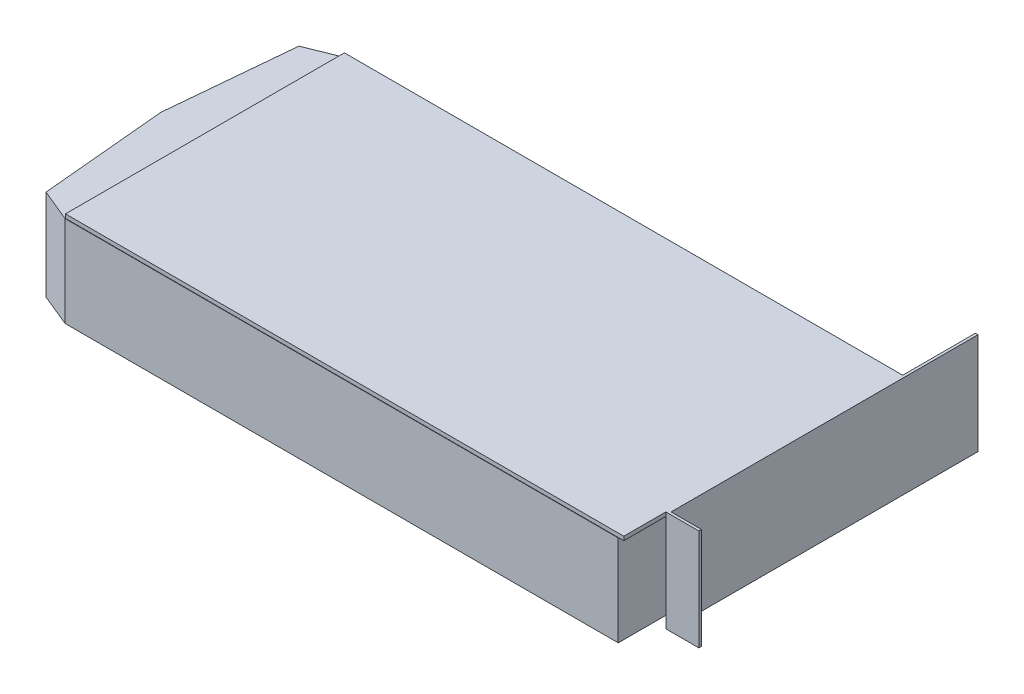
ISO-10303-21;
HEADER;
FILE_DESCRIPTION(('STEP AP214'),'2;1');
FILE_NAME('part.step','',(''),(''),'','','');
FILE_SCHEMA(('AUTOMOTIVE_DESIGN { 1 0 10303 214 1 1 1 1 }'));
ENDSEC;
DATA;
#1=APPLICATION_CONTEXT('core data for automotive mechanical design processes');
#2=APPLICATION_PROTOCOL_DEFINITION('international standard','automotive_design',2000,#1);
#3=PRODUCT_CONTEXT('',#1,'mechanical');
#4=PRODUCT('Part','Part','',(#3));
#5=PRODUCT_RELATED_PRODUCT_CATEGORY('part','',(#4));
#6=PRODUCT_DEFINITION_FORMATION('','',#4);
#7=PRODUCT_DEFINITION_CONTEXT('part definition',#1,'design');
#8=PRODUCT_DEFINITION('design','',#6,#7);
#9=PRODUCT_DEFINITION_SHAPE('','',#8);
#10=(LENGTH_UNIT() NAMED_UNIT(*) SI_UNIT(.MILLI.,.METRE.));
#11=(NAMED_UNIT(*) PLANE_ANGLE_UNIT() SI_UNIT($,.RADIAN.));
#12=(NAMED_UNIT(*) SI_UNIT($,.STERADIAN.) SOLID_ANGLE_UNIT());
#13=UNCERTAINTY_MEASURE_WITH_UNIT(LENGTH_MEASURE(1.E-05),#10,'distance_accuracy_value','');
#14=(GEOMETRIC_REPRESENTATION_CONTEXT(3) GLOBAL_UNCERTAINTY_ASSIGNED_CONTEXT((#13)) GLOBAL_UNIT_ASSIGNED_CONTEXT((#10,
#11,#12)) REPRESENTATION_CONTEXT('',''));
#15=CARTESIAN_POINT('',(0.,0.,0.));
#16=DIRECTION('',(0.,0.,1.));
#17=DIRECTION('',(1.,0.,0.));
#18=AXIS2_PLACEMENT_3D('',#15,#16,#17);
#19=CARTESIAN_POINT('',(0.,0.,0.));
#20=DIRECTION('',(0.,1.,0.));
#21=DIRECTION('',(0.,0.,1.));
#22=AXIS2_PLACEMENT_3D('',#19,#20,#21);
#23=PLANE('',#22);
#24=DIRECTION('',(0.,0.,1.));
#25=VECTOR('',#24,1.);
#26=CARTESIAN_POINT('',(213.,0.,0.));
#27=LINE('',#26,#25);
#28=CARTESIAN_POINT('',(213.,0.,-107.4));
#29=VERTEX_POINT('',#28);
#30=CARTESIAN_POINT('',(213.,0.,0.));
#31=VERTEX_POINT('',#30);
#32=EDGE_CURVE('E55',#29,#31,#27,.T.);
#33=ORIENTED_EDGE('',*,*,#32,.F.);
#34=DIRECTION('',(-1.,0.,0.));
#35=VECTOR('',#34,1.);
#36=CARTESIAN_POINT('',(0.,0.,-107.4));
#37=LINE('',#36,#35);
#38=CARTESIAN_POINT('',(215.,0.,-107.4));
#39=VERTEX_POINT('',#38);
#40=EDGE_CURVE('E285',#39,#29,#37,.T.);
#41=ORIENTED_EDGE('',*,*,#40,.F.);
#42=DIRECTION('',(0.,0.,-1.));
#43=VECTOR('',#42,1.);
#44=CARTESIAN_POINT('',(215.,0.,0.));
#45=LINE('',#44,#43);
#46=CARTESIAN_POINT('',(215.,0.,-16.2));
#47=VERTEX_POINT('',#46);
#48=EDGE_CURVE('E281',#47,#39,#45,.T.);
#49=ORIENTED_EDGE('',*,*,#48,.F.);
#50=CARTESIAN_POINT('',(215.,0.,0.));
#51=VERTEX_POINT('',#50);
#52=EDGE_CURVE('E282',#51,#47,#45,.T.);
#53=ORIENTED_EDGE('',*,*,#52,.F.);
#54=DIRECTION('',(1.,0.,0.));
#55=VECTOR('',#54,1.);
#56=CARTESIAN_POINT('',(0.,0.,0.));
#57=LINE('',#56,#55);
#58=EDGE_CURVE('E261',#31,#51,#57,.T.);
#59=ORIENTED_EDGE('',*,*,#58,.F.);
#60=EDGE_LOOP('',(#33,#41,#49,#53,#59));
#61=FACE_BOUND('',#60,.T.);
#62=ADVANCED_FACE('F39',(#61),#23,.F.);
#63=CARTESIAN_POINT('',(215.,1.5,0.));
#64=DIRECTION('',(-1.,0.,0.));
#65=DIRECTION('',(0.,0.,1.));
#66=AXIS2_PLACEMENT_3D('',#63,#64,#65);
#67=PLANE('',#66);
#68=DIRECTION('',(0.,-1.,0.));
#69=VECTOR('',#68,1.);
#70=CARTESIAN_POINT('',(215.,1.5,-16.2));
#71=LINE('',#70,#69);
#72=CARTESIAN_POINT('',(215.,1.5,-16.2));
#73=VERTEX_POINT('',#72);
#74=EDGE_CURVE('E237',#73,#47,#71,.T.);
#75=ORIENTED_EDGE('',*,*,#74,.F.);
#76=DIRECTION('',(0.,0.,-1.));
#77=VECTOR('',#76,1.);
#78=CARTESIAN_POINT('',(215.,1.5,0.));
#79=LINE('',#78,#77);
#80=CARTESIAN_POINT('',(215.,1.5,0.));
#81=VERTEX_POINT('',#80);
#82=EDGE_CURVE('E266',#81,#73,#79,.T.);
#83=ORIENTED_EDGE('',*,*,#82,.F.);
#84=DIRECTION('',(0.,-1.,0.));
#85=VECTOR('',#84,1.);
#86=CARTESIAN_POINT('',(215.,1.5,0.));
#87=LINE('',#86,#85);
#88=EDGE_CURVE('E11',#81,#51,#87,.T.);
#89=ORIENTED_EDGE('',*,*,#88,.T.);
#90=ORIENTED_EDGE('',*,*,#52,.T.);
#91=EDGE_LOOP('',(#75,#83,#89,#90));
#92=FACE_BOUND('',#91,.T.);
#93=ADVANCED_FACE('F338',(#92),#67,.F.);
#94=CARTESIAN_POINT('',(0.,1.5,0.));
#95=DIRECTION('',(0.,0.,-1.));
#96=DIRECTION('',(-1.,0.,0.));
#97=AXIS2_PLACEMENT_3D('',#94,#95,#96);
#98=PLANE('',#97);
#99=CARTESIAN_POINT('',(0.,0.,0.));
#100=VERTEX_POINT('',#99);
#101=EDGE_CURVE('E278',#100,#31,#57,.T.);
#102=ORIENTED_EDGE('',*,*,#101,.T.);
#103=ORIENTED_EDGE('',*,*,#58,.T.);
#104=ORIENTED_EDGE('',*,*,#88,.F.);
#105=DIRECTION('',(1.,0.,0.));
#106=VECTOR('',#105,1.);
#107=CARTESIAN_POINT('',(0.,1.5,0.));
#108=LINE('',#107,#106);
#109=CARTESIAN_POINT('',(0.,1.5,0.));
#110=VERTEX_POINT('',#109);
#111=EDGE_CURVE('E262',#110,#81,#108,.T.);
#112=ORIENTED_EDGE('',*,*,#111,.F.);
#113=DIRECTION('',(0.,-1.,0.));
#114=VECTOR('',#113,1.);
#115=CARTESIAN_POINT('',(0.,1.5,0.));
#116=LINE('',#115,#114);
#117=EDGE_CURVE('E277',#110,#100,#116,.T.);
#118=ORIENTED_EDGE('',*,*,#117,.T.);
#119=EDGE_LOOP('',(#102,#103,#104,#112,#118));
#120=FACE_BOUND('',#119,.T.);
#121=ADVANCED_FACE('F41',(#120),#98,.F.);
#122=CARTESIAN_POINT('',(0.,1.5,-107.4));
#123=DIRECTION('',(0.,0.,1.));
#124=DIRECTION('',(1.,0.,0.));
#125=AXIS2_PLACEMENT_3D('',#122,#123,#124);
#126=PLANE('',#125);
#127=ORIENTED_EDGE('',*,*,#40,.T.);
#128=DIRECTION('',(0.,1.,0.));
#129=VECTOR('',#128,1.);
#130=CARTESIAN_POINT('',(213.,-35.,-107.4));
#131=LINE('',#130,#129);
#132=CARTESIAN_POINT('',(213.,-35.,-107.4));
#133=VERTEX_POINT('',#132);
#134=EDGE_CURVE('E349',#133,#29,#131,.T.);
#135=ORIENTED_EDGE('',*,*,#134,.F.);
#136=DIRECTION('',(1.,0.,0.));
#137=VECTOR('',#136,1.);
#138=CARTESIAN_POINT('',(213.,-35.,-107.4));
#139=LINE('',#138,#137);
#140=CARTESIAN_POINT('',(0.,-35.,-107.4));
#141=VERTEX_POINT('',#140);
#142=EDGE_CURVE('E180',#141,#133,#139,.T.);
#143=ORIENTED_EDGE('',*,*,#142,.F.);
#144=DIRECTION('',(0.,1.,0.));
#145=VECTOR('',#144,1.);
#146=CARTESIAN_POINT('',(0.,-35.,-107.4));
#147=LINE('',#146,#145);
#148=CARTESIAN_POINT('',(0.,0.,-107.4));
#149=VERTEX_POINT('',#148);
#150=EDGE_CURVE('E356',#141,#149,#147,.T.);
#151=ORIENTED_EDGE('',*,*,#150,.T.);
#152=DIRECTION('',(0.,-1.,0.));
#153=VECTOR('',#152,1.);
#154=CARTESIAN_POINT('',(0.,1.5,-107.4));
#155=LINE('',#154,#153);
#156=CARTESIAN_POINT('',(0.,1.5,-107.4));
#157=VERTEX_POINT('',#156);
#158=EDGE_CURVE('E293',#157,#149,#155,.T.);
#159=ORIENTED_EDGE('',*,*,#158,.F.);
#160=DIRECTION('',(-1.,0.,0.));
#161=VECTOR('',#160,1.);
#162=CARTESIAN_POINT('',(0.,1.5,-107.4));
#163=LINE('',#162,#161);
#164=CARTESIAN_POINT('',(215.,1.5,-107.4));
#165=VERTEX_POINT('',#164);
#166=EDGE_CURVE('E271',#165,#157,#163,.T.);
#167=ORIENTED_EDGE('',*,*,#166,.F.);
#168=DIRECTION('',(0.,-1.,0.));
#169=VECTOR('',#168,1.);
#170=CARTESIAN_POINT('',(215.,1.5,-107.4));
#171=LINE('',#170,#169);
#172=EDGE_CURVE('E48',#165,#39,#171,.T.);
#173=ORIENTED_EDGE('',*,*,#172,.T.);
#174=EDGE_LOOP('',(#127,#135,#143,#151,#159,#167,#173));
#175=FACE_BOUND('',#174,.T.);
#176=ADVANCED_FACE('F298',(#175),#126,.F.);
#177=CARTESIAN_POINT('',(0.,1.5,0.));
#178=DIRECTION('',(1.,0.,0.));
#179=DIRECTION('',(0.,0.,-1.));
#180=AXIS2_PLACEMENT_3D('',#177,#178,#179);
#181=PLANE('',#180);
#182=DIRECTION('',(0.,0.,1.));
#183=VECTOR('',#182,1.);
#184=CARTESIAN_POINT('',(0.,0.,0.));
#185=LINE('',#184,#183);
#186=EDGE_CURVE('E267',#149,#100,#185,.T.);
#187=ORIENTED_EDGE('',*,*,#186,.T.);
#188=ORIENTED_EDGE('',*,*,#117,.F.);
#189=DIRECTION('',(0.,0.,1.));
#190=VECTOR('',#189,1.);
#191=CARTESIAN_POINT('',(0.,1.5,0.));
#192=LINE('',#191,#190);
#193=EDGE_CURVE('E274',#157,#110,#192,.T.);
#194=ORIENTED_EDGE('',*,*,#193,.F.);
#195=ORIENTED_EDGE('',*,*,#158,.T.);
#196=EDGE_LOOP('',(#187,#188,#194,#195));
#197=FACE_BOUND('',#196,.T.);
#198=ADVANCED_FACE('F421',(#197),#181,.F.);
#199=CARTESIAN_POINT('',(0.,1.5,0.));
#200=DIRECTION('',(0.,1.,0.));
#201=DIRECTION('',(0.,0.,1.));
#202=AXIS2_PLACEMENT_3D('',#199,#200,#201);
#203=PLANE('',#202);
#204=ORIENTED_EDGE('',*,*,#111,.T.);
#205=ORIENTED_EDGE('',*,*,#82,.T.);
#206=DIRECTION('',(-1.,0.,0.));
#207=VECTOR('',#206,1.);
#208=CARTESIAN_POINT('',(216.,1.5,-16.2));
#209=LINE('',#208,#207);
#210=CARTESIAN_POINT('',(227.7,1.5,-16.2));
#211=VERTEX_POINT('',#210);
#212=EDGE_CURVE('E257',#211,#73,#209,.T.);
#213=ORIENTED_EDGE('',*,*,#212,.F.);
#214=DIRECTION('',(0.,0.,1.));
#215=VECTOR('',#214,1.);
#216=CARTESIAN_POINT('',(227.7,1.5,-16.2));
#217=LINE('',#216,#215);
#218=CARTESIAN_POINT('',(227.7,1.5,-17.2));
#219=VERTEX_POINT('',#218);
#220=EDGE_CURVE('E209',#219,#211,#217,.T.);
#221=ORIENTED_EDGE('',*,*,#220,.F.);
#222=DIRECTION('',(-1.,0.,0.));
#223=VECTOR('',#222,1.);
#224=CARTESIAN_POINT('',(227.7,1.5,-17.2));
#225=LINE('',#224,#223);
#226=CARTESIAN_POINT('',(216.,1.5,-17.2));
#227=VERTEX_POINT('',#226);
#228=EDGE_CURVE('E212',#219,#227,#225,.T.);
#229=ORIENTED_EDGE('',*,*,#228,.T.);
#230=DIRECTION('',(0.,0.,1.));
#231=VECTOR('',#230,1.);
#232=CARTESIAN_POINT('',(216.,1.5,-16.2));
#233=LINE('',#232,#231);
#234=CARTESIAN_POINT('',(216.,1.5,-135.4));
#235=VERTEX_POINT('',#234);
#236=EDGE_CURVE('E222',#235,#227,#233,.T.);
#237=ORIENTED_EDGE('',*,*,#236,.F.);
#238=DIRECTION('',(-1.,0.,0.));
#239=VECTOR('',#238,1.);
#240=CARTESIAN_POINT('',(216.,1.5,-135.4));
#241=LINE('',#240,#239);
#242=CARTESIAN_POINT('',(215.,1.5,-135.4));
#243=VERTEX_POINT('',#242);
#244=EDGE_CURVE('E232',#235,#243,#241,.T.);
#245=ORIENTED_EDGE('',*,*,#244,.T.);
#246=DIRECTION('',(0.,0.,1.));
#247=VECTOR('',#246,1.);
#248=CARTESIAN_POINT('',(215.,1.5,-16.2));
#249=LINE('',#248,#247);
#250=EDGE_CURVE('E221',#243,#165,#249,.T.);
#251=ORIENTED_EDGE('',*,*,#250,.T.);
#252=ORIENTED_EDGE('',*,*,#166,.T.);
#253=ORIENTED_EDGE('',*,*,#193,.T.);
#254=EDGE_LOOP('',(#204,#205,#213,#221,#229,#237,#245,#251,#252,#253));
#255=FACE_BOUND('',#254,.T.);
#256=ADVANCED_FACE('F326',(#255),#203,.T.);
#257=CARTESIAN_POINT('',(215.,0.,0.));
#258=DIRECTION('',(1.,0.,0.));
#259=DIRECTION('',(0.,0.,-1.));
#260=AXIS2_PLACEMENT_3D('',#257,#258,#259);
#261=PLANE('',#260);
#262=CARTESIAN_POINT('',(215.,-37.5,-16.2));
#263=VERTEX_POINT('',#262);
#264=EDGE_CURVE('E236',#47,#263,#71,.T.);
#265=ORIENTED_EDGE('',*,*,#264,.F.);
#266=ORIENTED_EDGE('',*,*,#48,.T.);
#267=ORIENTED_EDGE('',*,*,#172,.F.);
#268=ORIENTED_EDGE('',*,*,#250,.F.);
#269=DIRECTION('',(0.,1.,0.));
#270=VECTOR('',#269,1.);
#271=CARTESIAN_POINT('',(215.,-37.5,-135.4));
#272=LINE('',#271,#270);
#273=CARTESIAN_POINT('',(215.,-37.5,-135.4));
#274=VERTEX_POINT('',#273);
#275=EDGE_CURVE('E226',#274,#243,#272,.T.);
#276=ORIENTED_EDGE('',*,*,#275,.F.);
#277=DIRECTION('',(0.,0.,-1.));
#278=VECTOR('',#277,1.);
#279=CARTESIAN_POINT('',(215.,-37.5,-16.2));
#280=LINE('',#279,#278);
#281=EDGE_CURVE('E241',#263,#274,#280,.T.);
#282=ORIENTED_EDGE('',*,*,#281,.F.);
#283=EDGE_LOOP('',(#265,#266,#267,#268,#276,#282));
#284=FACE_BOUND('',#283,.T.);
#285=ADVANCED_FACE('F306',(#284),#261,.F.);
#286=CARTESIAN_POINT('',(216.,1.5,-16.2));
#287=DIRECTION('',(0.,0.,-1.));
#288=DIRECTION('',(0.,1.,0.));
#289=AXIS2_PLACEMENT_3D('',#286,#287,#288);
#290=PLANE('',#289);
#291=ORIENTED_EDGE('',*,*,#74,.T.);
#292=ORIENTED_EDGE('',*,*,#264,.T.);
#293=DIRECTION('',(-1.,0.,0.));
#294=VECTOR('',#293,1.);
#295=CARTESIAN_POINT('',(216.,-37.5,-16.2));
#296=LINE('',#295,#294);
#297=CARTESIAN_POINT('',(227.7,-37.5,-16.2));
#298=VERTEX_POINT('',#297);
#299=EDGE_CURVE('E253',#298,#263,#296,.T.);
#300=ORIENTED_EDGE('',*,*,#299,.F.);
#301=DIRECTION('',(0.,-1.,0.));
#302=VECTOR('',#301,1.);
#303=CARTESIAN_POINT('',(227.7,-37.5,-16.2));
#304=LINE('',#303,#302);
#305=EDGE_CURVE('E194',#211,#298,#304,.T.);
#306=ORIENTED_EDGE('',*,*,#305,.F.);
#307=ORIENTED_EDGE('',*,*,#212,.T.);
#308=EDGE_LOOP('',(#291,#292,#300,#306,#307));
#309=FACE_BOUND('',#308,.T.);
#310=ADVANCED_FACE('F312',(#309),#290,.F.);
#311=CARTESIAN_POINT('',(216.,-37.5,-16.2));
#312=DIRECTION('',(0.,1.,0.));
#313=DIRECTION('',(0.,0.,1.));
#314=AXIS2_PLACEMENT_3D('',#311,#312,#313);
#315=PLANE('',#314);
#316=ORIENTED_EDGE('',*,*,#281,.T.);
#317=DIRECTION('',(-1.,0.,0.));
#318=VECTOR('',#317,1.);
#319=CARTESIAN_POINT('',(216.,-37.5,-135.4));
#320=LINE('',#319,#318);
#321=CARTESIAN_POINT('',(216.,-37.5,-135.4));
#322=VERTEX_POINT('',#321);
#323=EDGE_CURVE('E249',#322,#274,#320,.T.);
#324=ORIENTED_EDGE('',*,*,#323,.F.);
#325=DIRECTION('',(0.,0.,-1.));
#326=VECTOR('',#325,1.);
#327=CARTESIAN_POINT('',(216.,-37.5,-16.2));
#328=LINE('',#327,#326);
#329=CARTESIAN_POINT('',(216.,-37.5,-17.2));
#330=VERTEX_POINT('',#329);
#331=EDGE_CURVE('E225',#330,#322,#328,.T.);
#332=ORIENTED_EDGE('',*,*,#331,.F.);
#333=DIRECTION('',(-1.,0.,0.));
#334=VECTOR('',#333,1.);
#335=CARTESIAN_POINT('',(227.7,-37.5,-17.2));
#336=LINE('',#335,#334);
#337=CARTESIAN_POINT('',(227.7,-37.5,-17.2));
#338=VERTEX_POINT('',#337);
#339=EDGE_CURVE('E217',#338,#330,#336,.T.);
#340=ORIENTED_EDGE('',*,*,#339,.F.);
#341=DIRECTION('',(0.,0.,-1.));
#342=VECTOR('',#341,1.);
#343=CARTESIAN_POINT('',(227.7,-37.5,-17.2));
#344=LINE('',#343,#342);
#345=EDGE_CURVE('E203',#298,#338,#344,.T.);
#346=ORIENTED_EDGE('',*,*,#345,.F.);
#347=ORIENTED_EDGE('',*,*,#299,.T.);
#348=EDGE_LOOP('',(#316,#324,#332,#340,#346,#347));
#349=FACE_BOUND('',#348,.T.);
#350=ADVANCED_FACE('F316',(#349),#315,.F.);
#351=CARTESIAN_POINT('',(216.,-37.5,-135.4));
#352=DIRECTION('',(0.,0.,1.));
#353=DIRECTION('',(1.,0.,0.));
#354=AXIS2_PLACEMENT_3D('',#351,#352,#353);
#355=PLANE('',#354);
#356=ORIENTED_EDGE('',*,*,#275,.T.);
#357=ORIENTED_EDGE('',*,*,#244,.F.);
#358=DIRECTION('',(0.,1.,0.));
#359=VECTOR('',#358,1.);
#360=CARTESIAN_POINT('',(216.,-37.5,-135.4));
#361=LINE('',#360,#359);
#362=EDGE_CURVE('E229',#322,#235,#361,.T.);
#363=ORIENTED_EDGE('',*,*,#362,.F.);
#364=ORIENTED_EDGE('',*,*,#323,.T.);
#365=EDGE_LOOP('',(#356,#357,#363,#364));
#366=FACE_BOUND('',#365,.T.);
#367=ADVANCED_FACE('F322',(#366),#355,.F.);
#368=CARTESIAN_POINT('',(216.,0.,0.));
#369=DIRECTION('',(1.,0.,0.));
#370=DIRECTION('',(0.,0.,-1.));
#371=AXIS2_PLACEMENT_3D('',#368,#369,#370);
#372=PLANE('',#371);
#373=DIRECTION('',(0.,1.,0.));
#374=VECTOR('',#373,1.);
#375=CARTESIAN_POINT('',(216.,1.5,-17.2));
#376=LINE('',#375,#374);
#377=EDGE_CURVE('E63',#330,#227,#376,.T.);
#378=ORIENTED_EDGE('',*,*,#377,.F.);
#379=ORIENTED_EDGE('',*,*,#331,.T.);
#380=ORIENTED_EDGE('',*,*,#362,.T.);
#381=ORIENTED_EDGE('',*,*,#236,.T.);
#382=EDGE_LOOP('',(#378,#379,#380,#381));
#383=FACE_BOUND('',#382,.T.);
#384=ADVANCED_FACE('F329',(#383),#372,.T.);
#385=CARTESIAN_POINT('',(227.7,1.5,-17.2));
#386=DIRECTION('',(0.,0.,1.));
#387=DIRECTION('',(1.,0.,0.));
#388=AXIS2_PLACEMENT_3D('',#385,#386,#387);
#389=PLANE('',#388);
#390=ORIENTED_EDGE('',*,*,#377,.T.);
#391=ORIENTED_EDGE('',*,*,#228,.F.);
#392=DIRECTION('',(0.,1.,0.));
#393=VECTOR('',#392,1.);
#394=CARTESIAN_POINT('',(227.7,1.5,-17.2));
#395=LINE('',#394,#393);
#396=EDGE_CURVE('E206',#338,#219,#395,.T.);
#397=ORIENTED_EDGE('',*,*,#396,.F.);
#398=ORIENTED_EDGE('',*,*,#339,.T.);
#399=EDGE_LOOP('',(#390,#391,#397,#398));
#400=FACE_BOUND('',#399,.T.);
#401=ADVANCED_FACE('F331',(#400),#389,.F.);
#402=CARTESIAN_POINT('',(227.7,0.,0.));
#403=DIRECTION('',(-1.,0.,0.));
#404=DIRECTION('',(0.,0.,1.));
#405=AXIS2_PLACEMENT_3D('',#402,#403,#404);
#406=PLANE('',#405);
#407=ORIENTED_EDGE('',*,*,#305,.T.);
#408=ORIENTED_EDGE('',*,*,#345,.T.);
#409=ORIENTED_EDGE('',*,*,#396,.T.);
#410=ORIENTED_EDGE('',*,*,#220,.T.);
#411=EDGE_LOOP('',(#407,#408,#409,#410));
#412=FACE_BOUND('',#411,.T.);
#413=ADVANCED_FACE('F334',(#412),#406,.F.);
#414=CARTESIAN_POINT('',(0.,0.,0.));
#415=DIRECTION('',(0.,1.,0.));
#416=DIRECTION('',(0.,0.,1.));
#417=AXIS2_PLACEMENT_3D('',#414,#415,#416);
#418=PLANE('',#417);
#419=ORIENTED_EDGE('',*,*,#101,.F.);
#420=ORIENTED_EDGE('',*,*,#186,.F.);
#421=DIRECTION('',(0.928476690885259,0.,-0.371390676354104));
#422=VECTOR('',#421,1.);
#423=CARTESIAN_POINT('',(0.,0.,-107.4));
#424=LINE('',#423,#422);
#425=CARTESIAN_POINT('',(-12.5,0.,-102.4));
#426=VERTEX_POINT('',#425);
#427=EDGE_CURVE('E347',#426,#149,#424,.T.);
#428=ORIENTED_EDGE('',*,*,#427,.F.);
#429=DIRECTION('',(0.092010496247355,0.,-0.995758037165814));
#430=VECTOR('',#429,1.);
#431=CARTESIAN_POINT('',(-17.,0.,-53.7));
#432=LINE('',#431,#430);
#433=CARTESIAN_POINT('',(-17.,0.,-53.7));
#434=VERTEX_POINT('',#433);
#435=EDGE_CURVE('E381',#434,#426,#432,.T.);
#436=ORIENTED_EDGE('',*,*,#435,.F.);
#437=DIRECTION('',(-0.0920104962473547,0.,-0.995758037165815));
#438=VECTOR('',#437,1.);
#439=CARTESIAN_POINT('',(-17.,0.,-53.7));
#440=LINE('',#439,#438);
#441=CARTESIAN_POINT('',(-12.5,0.,-5.));
#442=VERTEX_POINT('',#441);
#443=EDGE_CURVE('E375',#442,#434,#440,.T.);
#444=ORIENTED_EDGE('',*,*,#443,.F.);
#445=DIRECTION('',(-0.924833288805006,0.,-0.380372696073359));
#446=VECTOR('',#445,1.);
#447=CARTESIAN_POINT('',(-12.5,0.,-5.));
#448=LINE('',#447,#446);
#449=CARTESIAN_POINT('',(0.,0.,0.141098140034046));
#450=VERTEX_POINT('',#449);
#451=EDGE_CURVE('E379',#450,#442,#448,.T.);
#452=ORIENTED_EDGE('',*,*,#451,.F.);
#453=DIRECTION('',(-1.,0.,0.));
#454=VECTOR('',#453,1.);
#455=CARTESIAN_POINT('',(0.,0.,0.141098140034046));
#456=LINE('',#455,#454);
#457=CARTESIAN_POINT('',(213.,0.,0.141098140034046));
#458=VERTEX_POINT('',#457);
#459=EDGE_CURVE('E345',#458,#450,#456,.T.);
#460=ORIENTED_EDGE('',*,*,#459,.F.);
#461=EDGE_CURVE('E188',#31,#458,#27,.T.);
#462=ORIENTED_EDGE('',*,*,#461,.F.);
#463=EDGE_LOOP('',(#419,#420,#428,#436,#444,#452,#460,#462));
#464=FACE_BOUND('',#463,.T.);
#465=ADVANCED_FACE('F342',(#464),#418,.T.);
#466=CARTESIAN_POINT('',(0.,-35.,0.141098140034046));
#467=DIRECTION('',(0.,0.,-1.));
#468=DIRECTION('',(-1.,0.,0.));
#469=AXIS2_PLACEMENT_3D('',#466,#467,#468);
#470=PLANE('',#469);
#471=ORIENTED_EDGE('',*,*,#459,.T.);
#472=DIRECTION('',(0.,1.,0.));
#473=VECTOR('',#472,1.);
#474=CARTESIAN_POINT('',(0.,-35.,0.141098140034046));
#475=LINE('',#474,#473);
#476=CARTESIAN_POINT('',(0.,-35.,0.141098140034046));
#477=VERTEX_POINT('',#476);
#478=EDGE_CURVE('E170',#477,#450,#475,.T.);
#479=ORIENTED_EDGE('',*,*,#478,.F.);
#480=DIRECTION('',(-1.,0.,0.));
#481=VECTOR('',#480,1.);
#482=CARTESIAN_POINT('',(0.,-35.,0.141098140034046));
#483=LINE('',#482,#481);
#484=CARTESIAN_POINT('',(213.,-35.,0.141098140034046));
#485=VERTEX_POINT('',#484);
#486=EDGE_CURVE('E164',#485,#477,#483,.T.);
#487=ORIENTED_EDGE('',*,*,#486,.F.);
#488=DIRECTION('',(0.,1.,0.));
#489=VECTOR('',#488,1.);
#490=CARTESIAN_POINT('',(213.,-35.,0.141098140034046));
#491=LINE('',#490,#489);
#492=EDGE_CURVE('E168',#485,#458,#491,.T.);
#493=ORIENTED_EDGE('',*,*,#492,.T.);
#494=EDGE_LOOP('',(#471,#479,#487,#493));
#495=FACE_BOUND('',#494,.T.);
#496=ADVANCED_FACE('F166',(#495),#470,.F.);
#497=CARTESIAN_POINT('',(-12.5,-35.,-5.));
#498=DIRECTION('',(0.380372696073359,0.,-0.924833288805006));
#499=DIRECTION('',(-0.924833288805006,0.,-0.380372696073359));
#500=AXIS2_PLACEMENT_3D('',#497,#498,#499);
#501=PLANE('',#500);
#502=ORIENTED_EDGE('',*,*,#451,.T.);
#503=DIRECTION('',(0.,1.,0.));
#504=VECTOR('',#503,1.);
#505=CARTESIAN_POINT('',(-12.5,-35.,-5.));
#506=LINE('',#505,#504);
#507=CARTESIAN_POINT('',(-12.5,-35.,-5.));
#508=VERTEX_POINT('',#507);
#509=EDGE_CURVE('E196',#508,#442,#506,.T.);
#510=ORIENTED_EDGE('',*,*,#509,.F.);
#511=DIRECTION('',(-0.924833288805006,0.,-0.380372696073359));
#512=VECTOR('',#511,1.);
#513=CARTESIAN_POINT('',(-12.5,-35.,-5.));
#514=LINE('',#513,#512);
#515=EDGE_CURVE('E174',#477,#508,#514,.T.);
#516=ORIENTED_EDGE('',*,*,#515,.F.);
#517=ORIENTED_EDGE('',*,*,#478,.T.);
#518=EDGE_LOOP('',(#502,#510,#516,#517));
#519=FACE_BOUND('',#518,.T.);
#520=ADVANCED_FACE('F401',(#519),#501,.F.);
#521=CARTESIAN_POINT('',(-17.,-35.,-53.7));
#522=DIRECTION('',(0.995758037165815,0.,-0.0920104962473547));
#523=DIRECTION('',(-0.0920104962473547,0.,-0.995758037165815));
#524=AXIS2_PLACEMENT_3D('',#521,#522,#523);
#525=PLANE('',#524);
#526=ORIENTED_EDGE('',*,*,#443,.T.);
#527=DIRECTION('',(0.,1.,0.));
#528=VECTOR('',#527,1.);
#529=CARTESIAN_POINT('',(-17.,-35.,-53.7));
#530=LINE('',#529,#528);
#531=CARTESIAN_POINT('',(-17.,-35.,-53.7));
#532=VERTEX_POINT('',#531);
#533=EDGE_CURVE('E364',#532,#434,#530,.T.);
#534=ORIENTED_EDGE('',*,*,#533,.F.);
#535=DIRECTION('',(-0.0920104962473547,0.,-0.995758037165815));
#536=VECTOR('',#535,1.);
#537=CARTESIAN_POINT('',(-17.,-35.,-53.7));
#538=LINE('',#537,#536);
#539=EDGE_CURVE('E376',#508,#532,#538,.T.);
#540=ORIENTED_EDGE('',*,*,#539,.F.);
#541=ORIENTED_EDGE('',*,*,#509,.T.);
#542=EDGE_LOOP('',(#526,#534,#540,#541));
#543=FACE_BOUND('',#542,.T.);
#544=ADVANCED_FACE('F373',(#543),#525,.F.);
#545=CARTESIAN_POINT('',(-17.,-35.,-53.7));
#546=DIRECTION('',(0.995758037165815,0.,0.092010496247355));
#547=DIRECTION('',(0.092010496247355,0.,-0.995758037165815));
#548=AXIS2_PLACEMENT_3D('',#545,#546,#547);
#549=PLANE('',#548);
#550=ORIENTED_EDGE('',*,*,#435,.T.);
#551=DIRECTION('',(0.,1.,0.));
#552=VECTOR('',#551,1.);
#553=CARTESIAN_POINT('',(-12.5,-35.,-102.4));
#554=LINE('',#553,#552);
#555=CARTESIAN_POINT('',(-12.5,-35.,-102.4));
#556=VERTEX_POINT('',#555);
#557=EDGE_CURVE('E360',#556,#426,#554,.T.);
#558=ORIENTED_EDGE('',*,*,#557,.F.);
#559=DIRECTION('',(0.092010496247355,0.,-0.995758037165814));
#560=VECTOR('',#559,1.);
#561=CARTESIAN_POINT('',(-17.,-35.,-53.7));
#562=LINE('',#561,#560);
#563=EDGE_CURVE('E395',#532,#556,#562,.T.);
#564=ORIENTED_EDGE('',*,*,#563,.F.);
#565=ORIENTED_EDGE('',*,*,#533,.T.);
#566=EDGE_LOOP('',(#550,#558,#564,#565));
#567=FACE_BOUND('',#566,.T.);
#568=ADVANCED_FACE('F408',(#567),#549,.F.);
#569=CARTESIAN_POINT('',(0.,-35.,-107.4));
#570=DIRECTION('',(0.371390676354104,0.,0.928476690885259));
#571=DIRECTION('',(0.928476690885259,0.,-0.371390676354104));
#572=AXIS2_PLACEMENT_3D('',#569,#570,#571);
#573=PLANE('',#572);
#574=ORIENTED_EDGE('',*,*,#427,.T.);
#575=ORIENTED_EDGE('',*,*,#150,.F.);
#576=DIRECTION('',(0.928476690885259,0.,-0.371390676354104));
#577=VECTOR('',#576,1.);
#578=CARTESIAN_POINT('',(0.,-35.,-107.4));
#579=LINE('',#578,#577);
#580=EDGE_CURVE('E392',#556,#141,#579,.T.);
#581=ORIENTED_EDGE('',*,*,#580,.F.);
#582=ORIENTED_EDGE('',*,*,#557,.T.);
#583=EDGE_LOOP('',(#574,#575,#581,#582));
#584=FACE_BOUND('',#583,.T.);
#585=ADVANCED_FACE('F437',(#584),#573,.F.);
#586=CARTESIAN_POINT('',(213.,-35.,0.));
#587=DIRECTION('',(-1.,0.,0.));
#588=DIRECTION('',(0.,0.,1.));
#589=AXIS2_PLACEMENT_3D('',#586,#587,#588);
#590=PLANE('',#589);
#591=ORIENTED_EDGE('',*,*,#32,.T.);
#592=ORIENTED_EDGE('',*,*,#461,.T.);
#593=ORIENTED_EDGE('',*,*,#492,.F.);
#594=DIRECTION('',(0.,0.,1.));
#595=VECTOR('',#594,1.);
#596=CARTESIAN_POINT('',(213.,-35.,0.141098140034046));
#597=LINE('',#596,#595);
#598=EDGE_CURVE('E175',#133,#485,#597,.T.);
#599=ORIENTED_EDGE('',*,*,#598,.F.);
#600=ORIENTED_EDGE('',*,*,#134,.T.);
#601=EDGE_LOOP('',(#591,#592,#593,#599,#600));
#602=FACE_BOUND('',#601,.T.);
#603=ADVANCED_FACE('F186',(#602),#590,.F.);
#604=CARTESIAN_POINT('',(0.,-35.,0.));
#605=DIRECTION('',(0.,1.,0.));
#606=DIRECTION('',(0.,0.,1.));
#607=AXIS2_PLACEMENT_3D('',#604,#605,#606);
#608=PLANE('',#607);
#609=ORIENTED_EDGE('',*,*,#598,.T.);
#610=ORIENTED_EDGE('',*,*,#486,.T.);
#611=ORIENTED_EDGE('',*,*,#515,.T.);
#612=ORIENTED_EDGE('',*,*,#539,.T.);
#613=ORIENTED_EDGE('',*,*,#563,.T.);
#614=ORIENTED_EDGE('',*,*,#580,.T.);
#615=ORIENTED_EDGE('',*,*,#142,.T.);
#616=EDGE_LOOP('',(#609,#610,#611,#612,#613,#614,#615));
#617=FACE_BOUND('',#616,.T.);
#618=ADVANCED_FACE('F178',(#617),#608,.F.);
#619=CLOSED_SHELL('',(#62,#93,#121,#176,#198,#256,#285,#310,#350,#367,#384,#401,#413,#465,#496,
#520,#544,#568,#585,#603,#618));
#620=MANIFOLD_SOLID_BREP('B2',#619);
#621=ADVANCED_BREP_SHAPE_REPRESENTATION('',(#18,#620),#14);
#622=SHAPE_DEFINITION_REPRESENTATION(#9,#621);
ENDSEC;
END-ISO-10303-21;
